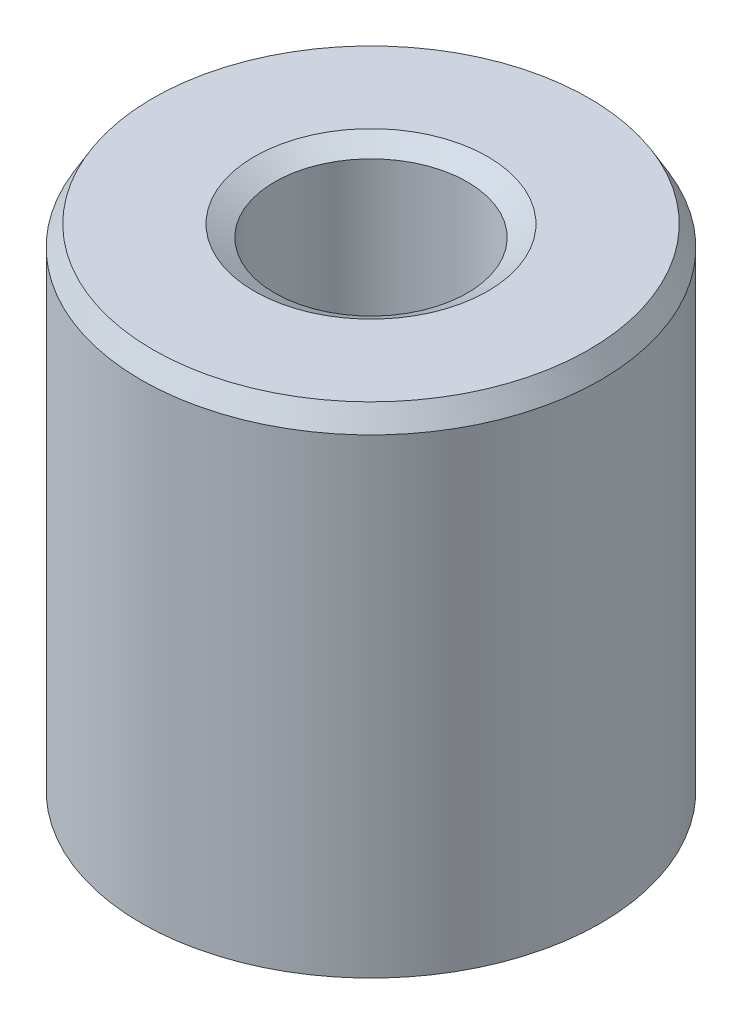
ISO-10303-21;
HEADER;
FILE_DESCRIPTION(('STEP AP214'),'2;1');
FILE_NAME('part.step','',(''),(''),'','','');
FILE_SCHEMA(('AUTOMOTIVE_DESIGN { 1 0 10303 214 1 1 1 1 }'));
ENDSEC;
DATA;
#1=APPLICATION_CONTEXT('core data for automotive mechanical design processes');
#2=APPLICATION_PROTOCOL_DEFINITION('international standard','automotive_design',2000,#1);
#3=PRODUCT_CONTEXT('',#1,'mechanical');
#4=PRODUCT('Part','Part','',(#3));
#5=PRODUCT_RELATED_PRODUCT_CATEGORY('part','',(#4));
#6=PRODUCT_DEFINITION_FORMATION('','',#4);
#7=PRODUCT_DEFINITION_CONTEXT('part definition',#1,'design');
#8=PRODUCT_DEFINITION('design','',#6,#7);
#9=PRODUCT_DEFINITION_SHAPE('','',#8);
#10=(LENGTH_UNIT() NAMED_UNIT(*) SI_UNIT(.MILLI.,.METRE.));
#11=(NAMED_UNIT(*) PLANE_ANGLE_UNIT() SI_UNIT($,.RADIAN.));
#12=(NAMED_UNIT(*) SI_UNIT($,.STERADIAN.) SOLID_ANGLE_UNIT());
#13=UNCERTAINTY_MEASURE_WITH_UNIT(LENGTH_MEASURE(1.E-05),#10,'distance_accuracy_value','');
#14=(GEOMETRIC_REPRESENTATION_CONTEXT(3) GLOBAL_UNCERTAINTY_ASSIGNED_CONTEXT((#13)) GLOBAL_UNIT_ASSIGNED_CONTEXT((#10,
#11,#12)) REPRESENTATION_CONTEXT('',''));
#15=CARTESIAN_POINT('',(0.,0.,0.));
#16=DIRECTION('',(0.,0.,1.));
#17=DIRECTION('',(1.,0.,0.));
#18=AXIS2_PLACEMENT_3D('',#15,#16,#17);
#19=CARTESIAN_POINT('',(0.,82.0250850308076,0.));
#20=DIRECTION('',(0.,-1.,0.));
#21=DIRECTION('',(0.,0.,-1.));
#22=AXIS2_PLACEMENT_3D('',#19,#20,#21);
#23=CYLINDRICAL_SURFACE('',#22,37.5);
#24=CARTESIAN_POINT('',(0.,1.91689413306162,0.));
#25=DIRECTION('',(0.,1.,0.));
#26=DIRECTION('',(0.,0.,1.));
#27=AXIS2_PLACEMENT_3D('',#24,#25,#26);
#28=CIRCLE('',#27,37.5);
#29=CARTESIAN_POINT('',(0.,1.91689413306162,37.5));
#30=VERTEX_POINT('',#29);
#31=EDGE_CURVE('E10',#30,#30,#28,.T.);
#32=ORIENTED_EDGE('',*,*,#31,.T.);
#33=EDGE_LOOP('',(#32));
#34=FACE_BOUND('',#33,.T.);
#35=CARTESIAN_POINT('',(0.,78.7049269996141,0.));
#36=DIRECTION('',(0.,1.,0.));
#37=DIRECTION('',(0.,0.,1.));
#38=AXIS2_PLACEMENT_3D('',#35,#36,#37);
#39=CIRCLE('',#38,37.5);
#40=CARTESIAN_POINT('',(0.,78.7049269996141,37.5));
#41=VERTEX_POINT('',#40);
#42=EDGE_CURVE('E50',#41,#41,#39,.F.);
#43=ORIENTED_EDGE('',*,*,#42,.T.);
#44=EDGE_LOOP('',(#43));
#45=FACE_BOUND('',#44,.T.);
#46=ADVANCED_FACE('F39',(#34,#45),#23,.T.);
#47=CARTESIAN_POINT('',(0.,82.0250850308076,0.));
#48=DIRECTION('',(0.,1.,0.));
#49=DIRECTION('',(0.,0.,1.));
#50=AXIS2_PLACEMENT_3D('',#47,#48,#49);
#51=PLANE('',#50);
#52=CARTESIAN_POINT('',(0.,82.0250850308076,0.));
#53=DIRECTION('',(0.,1.,0.));
#54=DIRECTION('',(0.,0.,1.));
#55=AXIS2_PLACEMENT_3D('',#52,#53,#54);
#56=CIRCLE('',#55,19.0455189213403);
#57=CARTESIAN_POINT('',(0.,82.0250850308076,19.0455189213403));
#58=VERTEX_POINT('',#57);
#59=EDGE_CURVE('E58',#58,#58,#56,.F.);
#60=ORIENTED_EDGE('',*,*,#59,.T.);
#61=EDGE_LOOP('',(#60));
#62=FACE_BOUND('',#61,.T.);
#63=CARTESIAN_POINT('',(0.,82.0250850308076,0.));
#64=DIRECTION('',(0.,1.,0.));
#65=DIRECTION('',(0.,0.,1.));
#66=AXIS2_PLACEMENT_3D('',#63,#64,#65);
#67=CIRCLE('',#66,35.5831058669384);
#68=CARTESIAN_POINT('',(0.,82.0250850308076,35.5831058669384));
#69=VERTEX_POINT('',#68);
#70=EDGE_CURVE('E61',#69,#69,#67,.T.);
#71=ORIENTED_EDGE('',*,*,#70,.T.);
#72=EDGE_LOOP('',(#71));
#73=FACE_BOUND('',#72,.T.);
#74=ADVANCED_FACE('F88',(#62,#73),#51,.T.);
#75=CARTESIAN_POINT('',(0.,0.,0.));
#76=DIRECTION('',(0.,1.,0.));
#77=DIRECTION('',(0.,0.,1.));
#78=AXIS2_PLACEMENT_3D('',#75,#76,#77);
#79=PLANE('',#78);
#80=CARTESIAN_POINT('',(0.,0.,0.));
#81=DIRECTION('',(0.,1.,0.));
#82=DIRECTION('',(0.,0.,1.));
#83=AXIS2_PLACEMENT_3D('',#80,#81,#82);
#84=CIRCLE('',#83,17.6422550232084);
#85=CARTESIAN_POINT('',(0.,0.,17.6422550232084));
#86=VERTEX_POINT('',#85);
#87=EDGE_CURVE('E51',#86,#86,#84,.T.);
#88=ORIENTED_EDGE('',*,*,#87,.T.);
#89=EDGE_LOOP('',(#88));
#90=FACE_BOUND('',#89,.T.);
#91=CARTESIAN_POINT('',(0.,0.,0.));
#92=DIRECTION('',(0.,1.,0.));
#93=DIRECTION('',(0.,0.,1.));
#94=AXIS2_PLACEMENT_3D('',#91,#92,#93);
#95=CIRCLE('',#94,34.1798419688065);
#96=CARTESIAN_POINT('',(0.,0.,34.1798419688065));
#97=VERTEX_POINT('',#96);
#98=EDGE_CURVE('E54',#97,#97,#95,.F.);
#99=ORIENTED_EDGE('',*,*,#98,.T.);
#100=EDGE_LOOP('',(#99));
#101=FACE_BOUND('',#100,.T.);
#102=ADVANCED_FACE('F83',(#90,#101),#79,.F.);
#103=CARTESIAN_POINT('',(0.,82.0250850308076,0.));
#104=DIRECTION('',(0.,-1.,0.));
#105=DIRECTION('',(0.,0.,-1.));
#106=AXIS2_PLACEMENT_3D('',#103,#104,#105);
#107=CYLINDRICAL_SURFACE('',#106,15.7253608901468);
#108=CARTESIAN_POINT('',(0.,80.108190897746,0.));
#109=DIRECTION('',(0.,1.,0.));
#110=DIRECTION('',(0.,0.,1.));
#111=AXIS2_PLACEMENT_3D('',#108,#109,#110);
#112=CIRCLE('',#111,15.7253608901468);
#113=CARTESIAN_POINT('',(0.,80.108190897746,15.7253608901468));
#114=VERTEX_POINT('',#113);
#115=EDGE_CURVE('E67',#114,#114,#112,.T.);
#116=ORIENTED_EDGE('',*,*,#115,.T.);
#117=EDGE_LOOP('',(#116));
#118=FACE_BOUND('',#117,.T.);
#119=CARTESIAN_POINT('',(0.,3.32015803119343,0.));
#120=DIRECTION('',(0.,1.,0.));
#121=DIRECTION('',(0.,0.,1.));
#122=AXIS2_PLACEMENT_3D('',#119,#120,#121);
#123=CIRCLE('',#122,15.7253608901468);
#124=CARTESIAN_POINT('',(0.,3.32015803119343,15.7253608901468));
#125=VERTEX_POINT('',#124);
#126=EDGE_CURVE('E69',#125,#125,#123,.F.);
#127=ORIENTED_EDGE('',*,*,#126,.T.);
#128=EDGE_LOOP('',(#127));
#129=FACE_BOUND('',#128,.T.);
#130=ADVANCED_FACE('F71',(#118,#129),#107,.F.);
#131=CARTESIAN_POINT('',(0.,80.108190897746,0.));
#132=DIRECTION('',(0.,1.,0.));
#133=DIRECTION('',(0.,0.,1.));
#134=AXIS2_PLACEMENT_3D('',#131,#132,#133);
#135=CONICAL_SURFACE('',#134,15.7253608901468,1.0471975511966);
#136=ORIENTED_EDGE('',*,*,#59,.F.);
#137=EDGE_LOOP('',(#136));
#138=FACE_BOUND('',#137,.T.);
#139=ORIENTED_EDGE('',*,*,#115,.F.);
#140=EDGE_LOOP('',(#139));
#141=FACE_BOUND('',#140,.T.);
#142=ADVANCED_FACE('F77',(#138,#141),#135,.F.);
#143=CARTESIAN_POINT('',(0.,0.,0.));
#144=DIRECTION('',(0.,-1.,0.));
#145=DIRECTION('',(0.,0.,-1.));
#146=AXIS2_PLACEMENT_3D('',#143,#144,#145);
#147=CONICAL_SURFACE('',#146,17.6422550232084,0.523598775598293);
#148=ORIENTED_EDGE('',*,*,#126,.F.);
#149=EDGE_LOOP('',(#148));
#150=FACE_BOUND('',#149,.T.);
#151=ORIENTED_EDGE('',*,*,#87,.F.);
#152=EDGE_LOOP('',(#151));
#153=FACE_BOUND('',#152,.T.);
#154=ADVANCED_FACE('F73',(#150,#153),#147,.F.);
#155=CARTESIAN_POINT('',(0.,1.91689413306162,0.));
#156=DIRECTION('',(0.,1.,0.));
#157=DIRECTION('',(0.,0.,1.));
#158=AXIS2_PLACEMENT_3D('',#155,#156,#157);
#159=CONICAL_SURFACE('',#158,37.5,1.0471975511966);
#160=CARTESIAN_POINT('',(0.,0.,34.1798419688065));
#161=CARTESIAN_POINT('',(0.,0.0199676472193917,34.2144269482981));
#162=CARTESIAN_POINT('',(0.,0.0399352944387835,34.2490119277898));
#163=CARTESIAN_POINT('',(0.,0.0798705888775673,34.3181818867729));
#164=CARTESIAN_POINT('',(0.,0.0998382360969591,34.3527668662645));
#165=CARTESIAN_POINT('',(0.,0.139773530535743,34.4219368252477));
#166=CARTESIAN_POINT('',(0.,0.159741177755135,34.4565218047393));
#167=CARTESIAN_POINT('',(0.,0.199676472193918,34.5256917637225));
#168=CARTESIAN_POINT('',(0.,0.21964411941331,34.5602767432141));
#169=CARTESIAN_POINT('',(0.,0.259579413852094,34.6294467021973));
#170=CARTESIAN_POINT('',(0.,0.279547061071486,34.6640316816889));
#171=CARTESIAN_POINT('',(0.,0.31948235551027,34.7332016406721));
#172=CARTESIAN_POINT('',(0.,0.339450002729662,34.7677866201637));
#173=CARTESIAN_POINT('',(0.,0.379385297168445,34.8369565791469));
#174=CARTESIAN_POINT('',(0.,0.399352944387837,34.8715415586385));
#175=CARTESIAN_POINT('',(0.,0.439288238826621,34.9407115176217));
#176=CARTESIAN_POINT('',(0.,0.459255886046013,34.9752964971133));
#177=CARTESIAN_POINT('',(0.,0.499191180484797,35.0444664560965));
#178=CARTESIAN_POINT('',(0.,0.519158827704188,35.0790514355881));
#179=CARTESIAN_POINT('',(0.,0.559094122142972,35.1482213945713));
#180=CARTESIAN_POINT('',(0.,0.579061769362364,35.1828063740629));
#181=CARTESIAN_POINT('',(0.,0.618997063801148,35.2519763330461));
#182=CARTESIAN_POINT('',(0.,0.63896471102054,35.2865613125377));
#183=CARTESIAN_POINT('',(0.,0.678900005459323,35.3557312715209));
#184=CARTESIAN_POINT('',(0.,0.698867652678715,35.3903162510125));
#185=CARTESIAN_POINT('',(0.,0.738802947117499,35.4594862099957));
#186=CARTESIAN_POINT('',(0.,0.758770594336891,35.4940711894873));
#187=CARTESIAN_POINT('',(0.,0.798705888775675,35.5632411484705));
#188=CARTESIAN_POINT('',(0.,0.818673535995067,35.5978261279621));
#189=CARTESIAN_POINT('',(0.,0.85860883043385,35.6669960869453));
#190=CARTESIAN_POINT('',(0.,0.878576477653242,35.7015810664369));
#191=CARTESIAN_POINT('',(0.,0.918511772092026,35.7707510254201));
#192=CARTESIAN_POINT('',(0.,0.938479419311418,35.8053360049117));
#193=CARTESIAN_POINT('',(0.,0.978414713750202,35.8745059638949));
#194=CARTESIAN_POINT('',(0.,0.998382360969594,35.9090909433865));
#195=CARTESIAN_POINT('',(0.,1.03831765540838,35.9782609023697));
#196=CARTESIAN_POINT('',(0.,1.05828530262777,36.0128458818613));
#197=CARTESIAN_POINT('',(0.,1.09822059706655,36.0820158408445));
#198=CARTESIAN_POINT('',(0.,1.11818824428594,36.1166008203361));
#199=CARTESIAN_POINT('',(0.,1.15812353872473,36.1857707793193));
#200=CARTESIAN_POINT('',(0.,1.17809118594412,36.2203557588109));
#201=CARTESIAN_POINT('',(0.,1.2180264803829,36.2895257177941));
#202=CARTESIAN_POINT('',(0.,1.2379941276023,36.3241106972857));
#203=CARTESIAN_POINT('',(0.,1.27792942204108,36.3932806562688));
#204=CARTESIAN_POINT('',(0.,1.29789706926047,36.4278656357605));
#205=CARTESIAN_POINT('',(0.,1.33783236369926,36.4970355947437));
#206=CARTESIAN_POINT('',(0.,1.35780001091865,36.5316205742352));
#207=CARTESIAN_POINT('',(0.,1.39773530535743,36.6007905332184));
#208=CARTESIAN_POINT('',(0.,1.41770295257682,36.63537551271));
#209=CARTESIAN_POINT('',(0.,1.45763824701561,36.7045454716932));
#210=CARTESIAN_POINT('',(0.,1.477605894235,36.7391304511848));
#211=CARTESIAN_POINT('',(0.,1.51754118867378,36.808300410168));
#212=CARTESIAN_POINT('',(0.,1.53750883589317,36.8428853896596));
#213=CARTESIAN_POINT('',(0.,1.57744413033196,36.9120553486428));
#214=CARTESIAN_POINT('',(0.,1.59741177755135,36.9466403281344));
#215=CARTESIAN_POINT('',(0.,1.63734707199013,37.0158102871176));
#216=CARTESIAN_POINT('',(0.,1.65731471920953,37.0503952666092));
#217=CARTESIAN_POINT('',(0.,1.69725001364831,37.1195652255924));
#218=CARTESIAN_POINT('',(0.,1.7172176608677,37.154150205084));
#219=CARTESIAN_POINT('',(0.,1.75715295530648,37.2233201640672));
#220=CARTESIAN_POINT('',(0.,1.77712060252588,37.2579051435588));
#221=CARTESIAN_POINT('',(0.,1.81705589696466,37.327075102542));
#222=CARTESIAN_POINT('',(0.,1.83702354418405,37.3616600820336));
#223=CARTESIAN_POINT('',(0.,1.87695883862284,37.4308300410168));
#224=CARTESIAN_POINT('',(0.,1.89692648584223,37.4654150205084));
#225=CARTESIAN_POINT('',(0.,1.91689413306162,37.5));
#226=B_SPLINE_CURVE_WITH_KNOTS('',3,(#160,#161,#162,#163,#164,#165,#166,#167,#168,#169,#170,
#171,#172,#173,#174,#175,#176,#177,#178,#179,#180,#181,#182,#183,#184,#185,#186,#187,#188,#189,
#190,#191,#192,#193,#194,#195,#196,#197,#198,#199,#200,#201,#202,#203,#204,#205,#206,#207,#208,
#209,#210,#211,#212,#213,#214,#215,#216,#217,#218,#219,#220,#221,#222,#223,#224,#225),
.UNSPECIFIED.,.F.,.F.,(4,2,2,2,2,2,2,2,2,2,2,2,2,2,2,2,2,2,2,2,2,2,2,2,2,2,2,2,2,2,2,2,4),(0.,
0.119805883316352,0.239611766632704,0.359417649949056,0.479223533265408,0.599029416581761,
0.718835299898113,0.838641183214465,0.958447066530817,1.07825294984717,1.19805883316352,
1.31786471647987,1.43767059979623,1.55747648311258,1.67728236642893,1.79708824974528,
1.91689413306163,2.03670001637799,2.15650589969434,2.27631178301069,2.39611766632704,
2.51592354964339,2.63572943295975,2.7555353162761,2.87534119959245,2.9951470829088,
3.11495296622515,3.23475884954151,3.35456473285786,3.47437061617421,3.59417649949056,
3.71398238280692,3.83378826612327),.UNSPECIFIED.);
#227=EDGE_CURVE('BSEAM76',#97,#30,#226,.T.);
#228=ORIENTED_EDGE('',*,*,#98,.F.);
#229=ORIENTED_EDGE('',*,*,#31,.F.);
#230=ORIENTED_EDGE('',*,*,#227,.T.);
#231=ORIENTED_EDGE('',*,*,#227,.F.);
#232=EDGE_LOOP('',(#228,#230,#229,#231));
#233=FACE_BOUND('',#232,.T.);
#234=ADVANCED_FACE('F76',(#233),#159,.T.);
#235=CARTESIAN_POINT('',(0.,82.0250850308076,0.));
#236=DIRECTION('',(0.,-1.,0.));
#237=DIRECTION('',(0.,0.,-1.));
#238=AXIS2_PLACEMENT_3D('',#235,#236,#237);
#239=CONICAL_SURFACE('',#238,35.5831058669384,0.523598775598291);
#240=ORIENTED_EDGE('',*,*,#42,.F.);
#241=EDGE_LOOP('',(#240));
#242=FACE_BOUND('',#241,.T.);
#243=ORIENTED_EDGE('',*,*,#70,.F.);
#244=EDGE_LOOP('',(#243));
#245=FACE_BOUND('',#244,.T.);
#246=ADVANCED_FACE('F45',(#242,#245),#239,.T.);
#247=CLOSED_SHELL('',(#46,#74,#102,#130,#142,#154,#234,#246));
#248=MANIFOLD_SOLID_BREP('B2',#247);
#249=ADVANCED_BREP_SHAPE_REPRESENTATION('',(#18,#248),#14);
#250=SHAPE_DEFINITION_REPRESENTATION(#9,#249);
ENDSEC;
END-ISO-10303-21;
